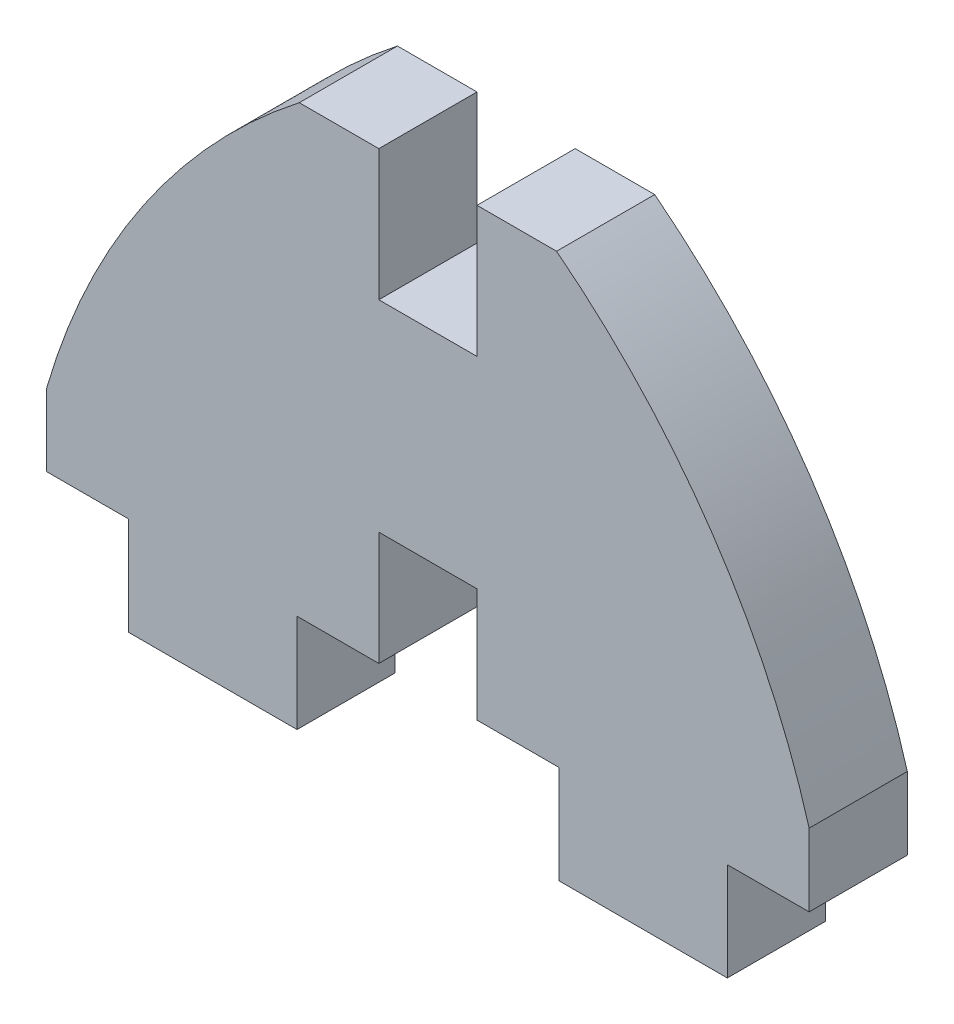
ISO-10303-21;
HEADER;
FILE_DESCRIPTION(('STEP AP214'),'2;1');
FILE_NAME('part.step','',(''),(''),'','','');
FILE_SCHEMA(('AUTOMOTIVE_DESIGN { 1 0 10303 214 1 1 1 1 }'));
ENDSEC;
DATA;
#1=APPLICATION_CONTEXT('core data for automotive mechanical design processes');
#2=APPLICATION_PROTOCOL_DEFINITION('international standard','automotive_design',2000,#1);
#3=PRODUCT_CONTEXT('',#1,'mechanical');
#4=PRODUCT('Part','Part','',(#3));
#5=PRODUCT_RELATED_PRODUCT_CATEGORY('part','',(#4));
#6=PRODUCT_DEFINITION_FORMATION('','',#4);
#7=PRODUCT_DEFINITION_CONTEXT('part definition',#1,'design');
#8=PRODUCT_DEFINITION('design','',#6,#7);
#9=PRODUCT_DEFINITION_SHAPE('','',#8);
#10=(LENGTH_UNIT() NAMED_UNIT(*) SI_UNIT(.MILLI.,.METRE.));
#11=(NAMED_UNIT(*) PLANE_ANGLE_UNIT() SI_UNIT($,.RADIAN.));
#12=(NAMED_UNIT(*) SI_UNIT($,.STERADIAN.) SOLID_ANGLE_UNIT());
#13=UNCERTAINTY_MEASURE_WITH_UNIT(LENGTH_MEASURE(1.E-05),#10,'distance_accuracy_value','');
#14=(GEOMETRIC_REPRESENTATION_CONTEXT(3) GLOBAL_UNCERTAINTY_ASSIGNED_CONTEXT((#13)) GLOBAL_UNIT_ASSIGNED_CONTEXT((#10,
#11,#12)) REPRESENTATION_CONTEXT('',''));
#15=CARTESIAN_POINT('',(0.,0.,0.));
#16=DIRECTION('',(0.,0.,1.));
#17=DIRECTION('',(1.,0.,0.));
#18=AXIS2_PLACEMENT_3D('',#15,#16,#17);
#19=CARTESIAN_POINT('',(-23.3,-6.95000000000001,6.));
#20=DIRECTION('',(-1.,0.,0.));
#21=DIRECTION('',(0.,0.,1.));
#22=AXIS2_PLACEMENT_3D('',#19,#20,#21);
#23=PLANE('',#22);
#24=DIRECTION('',(0.,1.,0.));
#25=VECTOR('',#24,1.);
#26=CARTESIAN_POINT('',(-23.3,-6.95000000000001,0.));
#27=LINE('',#26,#25);
#28=CARTESIAN_POINT('',(-23.3,-6.95000000000001,0.));
#29=VERTEX_POINT('',#28);
#30=CARTESIAN_POINT('',(-23.3,-2.51851851851852,0.));
#31=VERTEX_POINT('',#30);
#32=EDGE_CURVE('E214',#29,#31,#27,.T.);
#33=ORIENTED_EDGE('',*,*,#32,.F.);
#34=DIRECTION('',(0.,0.,-1.));
#35=VECTOR('',#34,1.);
#36=CARTESIAN_POINT('',(-23.3,-6.95000000000001,6.));
#37=LINE('',#36,#35);
#38=CARTESIAN_POINT('',(-23.3,-6.95000000000001,6.));
#39=VERTEX_POINT('',#38);
#40=EDGE_CURVE('E11',#39,#29,#37,.T.);
#41=ORIENTED_EDGE('',*,*,#40,.F.);
#42=DIRECTION('',(0.,1.,0.));
#43=VECTOR('',#42,1.);
#44=CARTESIAN_POINT('',(-23.3,-6.95000000000001,6.));
#45=LINE('',#44,#43);
#46=CARTESIAN_POINT('',(-23.3,-2.51851851851852,6.));
#47=VERTEX_POINT('',#46);
#48=EDGE_CURVE('E267',#39,#47,#45,.T.);
#49=ORIENTED_EDGE('',*,*,#48,.T.);
#50=DIRECTION('',(0.,0.,-1.));
#51=VECTOR('',#50,1.);
#52=CARTESIAN_POINT('',(-23.3,-2.51851851851852,6.));
#53=LINE('',#52,#51);
#54=EDGE_CURVE('E36',#47,#31,#53,.T.);
#55=ORIENTED_EDGE('',*,*,#54,.T.);
#56=EDGE_LOOP('',(#33,#41,#49,#55));
#57=FACE_BOUND('',#56,.T.);
#58=ADVANCED_FACE('F33',(#57),#23,.T.);
#59=CARTESIAN_POINT('',(-18.3,-6.95000000000001,6.));
#60=DIRECTION('',(0.,-1.,0.));
#61=DIRECTION('',(1.,0.,0.));
#62=AXIS2_PLACEMENT_3D('',#59,#60,#61);
#63=PLANE('',#62);
#64=DIRECTION('',(-1.,0.,0.));
#65=VECTOR('',#64,1.);
#66=CARTESIAN_POINT('',(-18.3,-6.95000000000001,0.));
#67=LINE('',#66,#65);
#68=CARTESIAN_POINT('',(-18.3,-6.95000000000001,0.));
#69=VERTEX_POINT('',#68);
#70=EDGE_CURVE('E265',#69,#29,#67,.T.);
#71=ORIENTED_EDGE('',*,*,#70,.F.);
#72=DIRECTION('',(0.,0.,-1.));
#73=VECTOR('',#72,1.);
#74=CARTESIAN_POINT('',(-18.3,-6.95000000000001,6.));
#75=LINE('',#74,#73);
#76=CARTESIAN_POINT('',(-18.3,-6.95000000000001,6.));
#77=VERTEX_POINT('',#76);
#78=EDGE_CURVE('E42',#77,#69,#75,.T.);
#79=ORIENTED_EDGE('',*,*,#78,.F.);
#80=DIRECTION('',(-1.,0.,0.));
#81=VECTOR('',#80,1.);
#82=CARTESIAN_POINT('',(-18.3,-6.95000000000001,6.));
#83=LINE('',#82,#81);
#84=EDGE_CURVE('E204',#77,#39,#83,.T.);
#85=ORIENTED_EDGE('',*,*,#84,.T.);
#86=ORIENTED_EDGE('',*,*,#40,.T.);
#87=EDGE_LOOP('',(#71,#79,#85,#86));
#88=FACE_BOUND('',#87,.T.);
#89=ADVANCED_FACE('F317',(#88),#63,.T.);
#90=CARTESIAN_POINT('',(-18.3,-12.95,6.));
#91=DIRECTION('',(-1.,0.,0.));
#92=DIRECTION('',(0.,-1.,0.));
#93=AXIS2_PLACEMENT_3D('',#90,#91,#92);
#94=PLANE('',#93);
#95=DIRECTION('',(0.,1.,0.));
#96=VECTOR('',#95,1.);
#97=CARTESIAN_POINT('',(-18.3,-12.95,0.));
#98=LINE('',#97,#96);
#99=CARTESIAN_POINT('',(-18.3,-12.95,0.));
#100=VERTEX_POINT('',#99);
#101=EDGE_CURVE('E191',#100,#69,#98,.T.);
#102=ORIENTED_EDGE('',*,*,#101,.F.);
#103=DIRECTION('',(0.,0.,-1.));
#104=VECTOR('',#103,1.);
#105=CARTESIAN_POINT('',(-18.3,-12.95,6.));
#106=LINE('',#105,#104);
#107=CARTESIAN_POINT('',(-18.3,-12.95,6.));
#108=VERTEX_POINT('',#107);
#109=EDGE_CURVE('E186',#108,#100,#106,.T.);
#110=ORIENTED_EDGE('',*,*,#109,.F.);
#111=DIRECTION('',(0.,1.,0.));
#112=VECTOR('',#111,1.);
#113=CARTESIAN_POINT('',(-18.3,-12.95,6.));
#114=LINE('',#113,#112);
#115=EDGE_CURVE('E189',#108,#77,#114,.T.);
#116=ORIENTED_EDGE('',*,*,#115,.T.);
#117=ORIENTED_EDGE('',*,*,#78,.T.);
#118=EDGE_LOOP('',(#102,#110,#116,#117));
#119=FACE_BOUND('',#118,.T.);
#120=ADVANCED_FACE('F188',(#119),#94,.T.);
#121=CARTESIAN_POINT('',(-8.,-12.95,6.));
#122=DIRECTION('',(0.,-1.,0.));
#123=DIRECTION('',(1.,0.,0.));
#124=AXIS2_PLACEMENT_3D('',#121,#122,#123);
#125=PLANE('',#124);
#126=DIRECTION('',(-1.,0.,0.));
#127=VECTOR('',#126,1.);
#128=CARTESIAN_POINT('',(-8.,-12.95,0.));
#129=LINE('',#128,#127);
#130=CARTESIAN_POINT('',(-8.,-12.95,0.));
#131=VERTEX_POINT('',#130);
#132=EDGE_CURVE('E262',#131,#100,#129,.T.);
#133=ORIENTED_EDGE('',*,*,#132,.F.);
#134=DIRECTION('',(0.,0.,-1.));
#135=VECTOR('',#134,1.);
#136=CARTESIAN_POINT('',(-8.,-12.95,6.));
#137=LINE('',#136,#135);
#138=CARTESIAN_POINT('',(-8.,-12.95,6.));
#139=VERTEX_POINT('',#138);
#140=EDGE_CURVE('E196',#139,#131,#137,.T.);
#141=ORIENTED_EDGE('',*,*,#140,.F.);
#142=DIRECTION('',(-1.,0.,0.));
#143=VECTOR('',#142,1.);
#144=CARTESIAN_POINT('',(-8.,-12.95,6.));
#145=LINE('',#144,#143);
#146=EDGE_CURVE('E202',#139,#108,#145,.T.);
#147=ORIENTED_EDGE('',*,*,#146,.T.);
#148=ORIENTED_EDGE('',*,*,#109,.T.);
#149=EDGE_LOOP('',(#133,#141,#147,#148));
#150=FACE_BOUND('',#149,.T.);
#151=ADVANCED_FACE('F206',(#150),#125,.T.);
#152=CARTESIAN_POINT('',(-8.,-6.95,6.));
#153=DIRECTION('',(1.,0.,0.));
#154=DIRECTION('',(0.,1.,0.));
#155=AXIS2_PLACEMENT_3D('',#152,#153,#154);
#156=PLANE('',#155);
#157=DIRECTION('',(0.,-1.,0.));
#158=VECTOR('',#157,1.);
#159=CARTESIAN_POINT('',(-8.,-6.95,0.));
#160=LINE('',#159,#158);
#161=CARTESIAN_POINT('',(-8.,-6.95,0.));
#162=VERTEX_POINT('',#161);
#163=EDGE_CURVE('E259',#162,#131,#160,.T.);
#164=ORIENTED_EDGE('',*,*,#163,.F.);
#165=DIRECTION('',(0.,0.,-1.));
#166=VECTOR('',#165,1.);
#167=CARTESIAN_POINT('',(-8.,-6.95,6.));
#168=LINE('',#167,#166);
#169=CARTESIAN_POINT('',(-8.,-6.95,6.));
#170=VERTEX_POINT('',#169);
#171=EDGE_CURVE('E271',#170,#162,#168,.T.);
#172=ORIENTED_EDGE('',*,*,#171,.F.);
#173=DIRECTION('',(0.,-1.,0.));
#174=VECTOR('',#173,1.);
#175=CARTESIAN_POINT('',(-8.,-6.95,6.));
#176=LINE('',#175,#174);
#177=EDGE_CURVE('E207',#170,#139,#176,.T.);
#178=ORIENTED_EDGE('',*,*,#177,.T.);
#179=ORIENTED_EDGE('',*,*,#140,.T.);
#180=EDGE_LOOP('',(#164,#172,#178,#179));
#181=FACE_BOUND('',#180,.T.);
#182=ADVANCED_FACE('F330',(#181),#156,.T.);
#183=CARTESIAN_POINT('',(-3.,-6.95,6.));
#184=DIRECTION('',(0.,-1.,0.));
#185=DIRECTION('',(0.,0.,-1.));
#186=AXIS2_PLACEMENT_3D('',#183,#184,#185);
#187=PLANE('',#186);
#188=DIRECTION('',(-1.,0.,0.));
#189=VECTOR('',#188,1.);
#190=CARTESIAN_POINT('',(-3.,-6.95,0.));
#191=LINE('',#190,#189);
#192=CARTESIAN_POINT('',(-3.,-6.95,0.));
#193=VERTEX_POINT('',#192);
#194=EDGE_CURVE('E256',#193,#162,#191,.T.);
#195=ORIENTED_EDGE('',*,*,#194,.F.);
#196=DIRECTION('',(0.,0.,-1.));
#197=VECTOR('',#196,1.);
#198=CARTESIAN_POINT('',(-3.,-6.95,6.));
#199=LINE('',#198,#197);
#200=CARTESIAN_POINT('',(-3.,-6.95,6.));
#201=VERTEX_POINT('',#200);
#202=EDGE_CURVE('E273',#201,#193,#199,.T.);
#203=ORIENTED_EDGE('',*,*,#202,.F.);
#204=DIRECTION('',(-1.,0.,0.));
#205=VECTOR('',#204,1.);
#206=CARTESIAN_POINT('',(-3.,-6.95,6.));
#207=LINE('',#206,#205);
#208=EDGE_CURVE('E209',#201,#170,#207,.T.);
#209=ORIENTED_EDGE('',*,*,#208,.T.);
#210=ORIENTED_EDGE('',*,*,#171,.T.);
#211=EDGE_LOOP('',(#195,#203,#209,#210));
#212=FACE_BOUND('',#211,.T.);
#213=ADVANCED_FACE('F333',(#212),#187,.T.);
#214=CARTESIAN_POINT('',(-3.,0.,6.));
#215=DIRECTION('',(1.,0.,0.));
#216=DIRECTION('',(0.,1.,0.));
#217=AXIS2_PLACEMENT_3D('',#214,#215,#216);
#218=PLANE('',#217);
#219=DIRECTION('',(0.,-1.,0.));
#220=VECTOR('',#219,1.);
#221=CARTESIAN_POINT('',(-3.,0.,0.));
#222=LINE('',#221,#220);
#223=CARTESIAN_POINT('',(-3.,0.,0.));
#224=VERTEX_POINT('',#223);
#225=EDGE_CURVE('E253',#224,#193,#222,.T.);
#226=ORIENTED_EDGE('',*,*,#225,.F.);
#227=DIRECTION('',(0.,0.,-1.));
#228=VECTOR('',#227,1.);
#229=CARTESIAN_POINT('',(-3.,0.,6.));
#230=LINE('',#229,#228);
#231=CARTESIAN_POINT('',(-3.,0.,6.));
#232=VERTEX_POINT('',#231);
#233=EDGE_CURVE('E275',#232,#224,#230,.T.);
#234=ORIENTED_EDGE('',*,*,#233,.F.);
#235=DIRECTION('',(0.,-1.,0.));
#236=VECTOR('',#235,1.);
#237=CARTESIAN_POINT('',(-3.,0.,6.));
#238=LINE('',#237,#236);
#239=EDGE_CURVE('E602',#232,#201,#238,.T.);
#240=ORIENTED_EDGE('',*,*,#239,.T.);
#241=ORIENTED_EDGE('',*,*,#202,.T.);
#242=EDGE_LOOP('',(#226,#234,#240,#241));
#243=FACE_BOUND('',#242,.T.);
#244=ADVANCED_FACE('F337',(#243),#218,.T.);
#245=CARTESIAN_POINT('',(3.,0.,6.));
#246=DIRECTION('',(0.,-1.,0.));
#247=DIRECTION('',(0.,0.,-1.));
#248=AXIS2_PLACEMENT_3D('',#245,#246,#247);
#249=PLANE('',#248);
#250=DIRECTION('',(-1.,0.,0.));
#251=VECTOR('',#250,1.);
#252=CARTESIAN_POINT('',(3.,0.,0.));
#253=LINE('',#252,#251);
#254=CARTESIAN_POINT('',(3.,0.,0.));
#255=VERTEX_POINT('',#254);
#256=EDGE_CURVE('E250',#255,#224,#253,.T.);
#257=ORIENTED_EDGE('',*,*,#256,.F.);
#258=DIRECTION('',(0.,0.,-1.));
#259=VECTOR('',#258,1.);
#260=CARTESIAN_POINT('',(3.,0.,6.));
#261=LINE('',#260,#259);
#262=CARTESIAN_POINT('',(3.,0.,6.));
#263=VERTEX_POINT('',#262);
#264=EDGE_CURVE('E277',#263,#255,#261,.T.);
#265=ORIENTED_EDGE('',*,*,#264,.F.);
#266=DIRECTION('',(-1.,0.,0.));
#267=VECTOR('',#266,1.);
#268=CARTESIAN_POINT('',(3.,0.,6.));
#269=LINE('',#268,#267);
#270=EDGE_CURVE('E595',#263,#232,#269,.T.);
#271=ORIENTED_EDGE('',*,*,#270,.T.);
#272=ORIENTED_EDGE('',*,*,#233,.T.);
#273=EDGE_LOOP('',(#257,#265,#271,#272));
#274=FACE_BOUND('',#273,.T.);
#275=ADVANCED_FACE('F341',(#274),#249,.T.);
#276=CARTESIAN_POINT('',(3.,0.,6.));
#277=DIRECTION('',(1.,0.,0.));
#278=DIRECTION('',(0.,1.,0.));
#279=AXIS2_PLACEMENT_3D('',#276,#277,#278);
#280=PLANE('',#279);
#281=DIRECTION('',(0.,-1.,0.));
#282=VECTOR('',#281,1.);
#283=CARTESIAN_POINT('',(3.,0.,0.));
#284=LINE('',#283,#282);
#285=CARTESIAN_POINT('',(3.,-6.95,0.));
#286=VERTEX_POINT('',#285);
#287=EDGE_CURVE('E248',#255,#286,#284,.T.);
#288=ORIENTED_EDGE('',*,*,#287,.T.);
#289=DIRECTION('',(0.,0.,-1.));
#290=VECTOR('',#289,1.);
#291=CARTESIAN_POINT('',(3.,-6.95,6.));
#292=LINE('',#291,#290);
#293=CARTESIAN_POINT('',(3.,-6.95,6.));
#294=VERTEX_POINT('',#293);
#295=EDGE_CURVE('E279',#294,#286,#292,.T.);
#296=ORIENTED_EDGE('',*,*,#295,.F.);
#297=DIRECTION('',(0.,-1.,0.));
#298=VECTOR('',#297,1.);
#299=CARTESIAN_POINT('',(3.,0.,6.));
#300=LINE('',#299,#298);
#301=EDGE_CURVE('E590',#263,#294,#300,.T.);
#302=ORIENTED_EDGE('',*,*,#301,.F.);
#303=ORIENTED_EDGE('',*,*,#264,.T.);
#304=EDGE_LOOP('',(#288,#296,#302,#303));
#305=FACE_BOUND('',#304,.T.);
#306=ADVANCED_FACE('F345',(#305),#280,.F.);
#307=CARTESIAN_POINT('',(3.,-6.95,6.));
#308=DIRECTION('',(0.,1.,0.));
#309=DIRECTION('',(0.,0.,1.));
#310=AXIS2_PLACEMENT_3D('',#307,#308,#309);
#311=PLANE('',#310);
#312=DIRECTION('',(1.,0.,0.));
#313=VECTOR('',#312,1.);
#314=CARTESIAN_POINT('',(3.,-6.95,0.));
#315=LINE('',#314,#313);
#316=CARTESIAN_POINT('',(8.,-6.95,0.));
#317=VERTEX_POINT('',#316);
#318=EDGE_CURVE('E246',#286,#317,#315,.T.);
#319=ORIENTED_EDGE('',*,*,#318,.T.);
#320=DIRECTION('',(0.,0.,-1.));
#321=VECTOR('',#320,1.);
#322=CARTESIAN_POINT('',(8.,-6.95,6.));
#323=LINE('',#322,#321);
#324=CARTESIAN_POINT('',(8.,-6.95,6.));
#325=VERTEX_POINT('',#324);
#326=EDGE_CURVE('E282',#325,#317,#323,.T.);
#327=ORIENTED_EDGE('',*,*,#326,.F.);
#328=DIRECTION('',(1.,0.,0.));
#329=VECTOR('',#328,1.);
#330=CARTESIAN_POINT('',(3.,-6.95,6.));
#331=LINE('',#330,#329);
#332=EDGE_CURVE('E587',#294,#325,#331,.T.);
#333=ORIENTED_EDGE('',*,*,#332,.F.);
#334=ORIENTED_EDGE('',*,*,#295,.T.);
#335=EDGE_LOOP('',(#319,#327,#333,#334));
#336=FACE_BOUND('',#335,.T.);
#337=ADVANCED_FACE('F349',(#336),#311,.F.);
#338=CARTESIAN_POINT('',(8.,-6.95,6.));
#339=DIRECTION('',(1.,0.,0.));
#340=DIRECTION('',(0.,1.,0.));
#341=AXIS2_PLACEMENT_3D('',#338,#339,#340);
#342=PLANE('',#341);
#343=DIRECTION('',(0.,-1.,0.));
#344=VECTOR('',#343,1.);
#345=CARTESIAN_POINT('',(8.,-6.95,0.));
#346=LINE('',#345,#344);
#347=CARTESIAN_POINT('',(8.,-12.95,0.));
#348=VERTEX_POINT('',#347);
#349=EDGE_CURVE('E244',#317,#348,#346,.T.);
#350=ORIENTED_EDGE('',*,*,#349,.T.);
#351=DIRECTION('',(0.,0.,-1.));
#352=VECTOR('',#351,1.);
#353=CARTESIAN_POINT('',(8.,-12.95,6.));
#354=LINE('',#353,#352);
#355=CARTESIAN_POINT('',(8.,-12.95,6.));
#356=VERTEX_POINT('',#355);
#357=EDGE_CURVE('E285',#356,#348,#354,.T.);
#358=ORIENTED_EDGE('',*,*,#357,.F.);
#359=DIRECTION('',(0.,-1.,0.));
#360=VECTOR('',#359,1.);
#361=CARTESIAN_POINT('',(8.,-6.95,6.));
#362=LINE('',#361,#360);
#363=EDGE_CURVE('E585',#325,#356,#362,.T.);
#364=ORIENTED_EDGE('',*,*,#363,.F.);
#365=ORIENTED_EDGE('',*,*,#326,.T.);
#366=EDGE_LOOP('',(#350,#358,#364,#365));
#367=FACE_BOUND('',#366,.T.);
#368=ADVANCED_FACE('F353',(#367),#342,.F.);
#369=CARTESIAN_POINT('',(8.,-12.95,6.));
#370=DIRECTION('',(0.,1.,0.));
#371=DIRECTION('',(-1.,0.,0.));
#372=AXIS2_PLACEMENT_3D('',#369,#370,#371);
#373=PLANE('',#372);
#374=DIRECTION('',(1.,0.,0.));
#375=VECTOR('',#374,1.);
#376=CARTESIAN_POINT('',(8.,-12.95,0.));
#377=LINE('',#376,#375);
#378=CARTESIAN_POINT('',(18.3,-12.95,0.));
#379=VERTEX_POINT('',#378);
#380=EDGE_CURVE('E242',#348,#379,#377,.T.);
#381=ORIENTED_EDGE('',*,*,#380,.T.);
#382=DIRECTION('',(0.,0.,-1.));
#383=VECTOR('',#382,1.);
#384=CARTESIAN_POINT('',(18.3,-12.95,6.));
#385=LINE('',#384,#383);
#386=CARTESIAN_POINT('',(18.3,-12.95,6.));
#387=VERTEX_POINT('',#386);
#388=EDGE_CURVE('E288',#387,#379,#385,.T.);
#389=ORIENTED_EDGE('',*,*,#388,.F.);
#390=DIRECTION('',(1.,0.,0.));
#391=VECTOR('',#390,1.);
#392=CARTESIAN_POINT('',(8.,-12.95,6.));
#393=LINE('',#392,#391);
#394=EDGE_CURVE('E578',#356,#387,#393,.T.);
#395=ORIENTED_EDGE('',*,*,#394,.F.);
#396=ORIENTED_EDGE('',*,*,#357,.T.);
#397=EDGE_LOOP('',(#381,#389,#395,#396));
#398=FACE_BOUND('',#397,.T.);
#399=ADVANCED_FACE('F357',(#398),#373,.F.);
#400=CARTESIAN_POINT('',(18.3,-12.95,6.));
#401=DIRECTION('',(-1.,0.,0.));
#402=DIRECTION('',(0.,-1.,0.));
#403=AXIS2_PLACEMENT_3D('',#400,#401,#402);
#404=PLANE('',#403);
#405=DIRECTION('',(0.,1.,0.));
#406=VECTOR('',#405,1.);
#407=CARTESIAN_POINT('',(18.3,-12.95,0.));
#408=LINE('',#407,#406);
#409=CARTESIAN_POINT('',(18.3,-6.95000000000001,0.));
#410=VERTEX_POINT('',#409);
#411=EDGE_CURVE('E240',#379,#410,#408,.T.);
#412=ORIENTED_EDGE('',*,*,#411,.T.);
#413=DIRECTION('',(0.,0.,-1.));
#414=VECTOR('',#413,1.);
#415=CARTESIAN_POINT('',(18.3,-6.95000000000001,6.));
#416=LINE('',#415,#414);
#417=CARTESIAN_POINT('',(18.3,-6.95000000000001,6.));
#418=VERTEX_POINT('',#417);
#419=EDGE_CURVE('E291',#418,#410,#416,.T.);
#420=ORIENTED_EDGE('',*,*,#419,.F.);
#421=DIRECTION('',(0.,1.,0.));
#422=VECTOR('',#421,1.);
#423=CARTESIAN_POINT('',(18.3,-12.95,6.));
#424=LINE('',#423,#422);
#425=EDGE_CURVE('E575',#387,#418,#424,.T.);
#426=ORIENTED_EDGE('',*,*,#425,.F.);
#427=ORIENTED_EDGE('',*,*,#388,.T.);
#428=EDGE_LOOP('',(#412,#420,#426,#427));
#429=FACE_BOUND('',#428,.T.);
#430=ADVANCED_FACE('F361',(#429),#404,.F.);
#431=CARTESIAN_POINT('',(18.3,-6.95000000000001,6.));
#432=DIRECTION('',(0.,1.,0.));
#433=DIRECTION('',(-1.,0.,0.));
#434=AXIS2_PLACEMENT_3D('',#431,#432,#433);
#435=PLANE('',#434);
#436=DIRECTION('',(1.,0.,0.));
#437=VECTOR('',#436,1.);
#438=CARTESIAN_POINT('',(18.3,-6.95000000000001,0.));
#439=LINE('',#438,#437);
#440=CARTESIAN_POINT('',(23.3,-6.95000000000001,0.));
#441=VERTEX_POINT('',#440);
#442=EDGE_CURVE('E238',#410,#441,#439,.T.);
#443=ORIENTED_EDGE('',*,*,#442,.T.);
#444=DIRECTION('',(0.,0.,-1.));
#445=VECTOR('',#444,1.);
#446=CARTESIAN_POINT('',(23.3,-6.95000000000001,6.));
#447=LINE('',#446,#445);
#448=CARTESIAN_POINT('',(23.3,-6.95000000000001,6.));
#449=VERTEX_POINT('',#448);
#450=EDGE_CURVE('E294',#449,#441,#447,.T.);
#451=ORIENTED_EDGE('',*,*,#450,.F.);
#452=DIRECTION('',(1.,0.,0.));
#453=VECTOR('',#452,1.);
#454=CARTESIAN_POINT('',(18.3,-6.95000000000001,6.));
#455=LINE('',#454,#453);
#456=EDGE_CURVE('E573',#418,#449,#455,.T.);
#457=ORIENTED_EDGE('',*,*,#456,.F.);
#458=ORIENTED_EDGE('',*,*,#419,.T.);
#459=EDGE_LOOP('',(#443,#451,#457,#458));
#460=FACE_BOUND('',#459,.T.);
#461=ADVANCED_FACE('F365',(#460),#435,.F.);
#462=CARTESIAN_POINT('',(23.3,-6.95000000000001,6.));
#463=DIRECTION('',(-1.,0.,0.));
#464=DIRECTION('',(0.,0.,1.));
#465=AXIS2_PLACEMENT_3D('',#462,#463,#464);
#466=PLANE('',#465);
#467=DIRECTION('',(0.,1.,0.));
#468=VECTOR('',#467,1.);
#469=CARTESIAN_POINT('',(23.3,-6.95000000000001,0.));
#470=LINE('',#469,#468);
#471=CARTESIAN_POINT('',(23.3,-2.51851851851852,0.));
#472=VERTEX_POINT('',#471);
#473=EDGE_CURVE('E236',#441,#472,#470,.T.);
#474=ORIENTED_EDGE('',*,*,#473,.T.);
#475=DIRECTION('',(0.,0.,-1.));
#476=VECTOR('',#475,1.);
#477=CARTESIAN_POINT('',(23.3,-2.51851851851852,6.));
#478=LINE('',#477,#476);
#479=CARTESIAN_POINT('',(23.3,-2.51851851851852,6.));
#480=VERTEX_POINT('',#479);
#481=EDGE_CURVE('E297',#480,#472,#478,.T.);
#482=ORIENTED_EDGE('',*,*,#481,.F.);
#483=DIRECTION('',(0.,1.,0.));
#484=VECTOR('',#483,1.);
#485=CARTESIAN_POINT('',(23.3,-6.95000000000001,6.));
#486=LINE('',#485,#484);
#487=EDGE_CURVE('E566',#449,#480,#486,.T.);
#488=ORIENTED_EDGE('',*,*,#487,.F.);
#489=ORIENTED_EDGE('',*,*,#450,.T.);
#490=EDGE_LOOP('',(#474,#482,#488,#489));
#491=FACE_BOUND('',#490,.T.);
#492=ADVANCED_FACE('F369',(#491),#466,.F.);
#493=CARTESIAN_POINT('',(-19.5785771108741,-14.8951701462014,6.));
#494=DIRECTION('',(0.,0.,-1.));
#495=DIRECTION('',(-1.,0.,0.));
#496=AXIS2_PLACEMENT_3D('',#493,#494,#495);
#497=CYLINDRICAL_SURFACE('',#496,44.6290699047852);
#498=CARTESIAN_POINT('',(-19.5785771108741,-14.8951701462014,0.));
#499=DIRECTION('',(0.,0.,1.));
#500=DIRECTION('',(1.,0.,0.));
#501=AXIS2_PLACEMENT_3D('',#498,#499,#500);
#502=CIRCLE('',#501,44.6290699047852);
#503=CARTESIAN_POINT('',(7.86325006856376,20.3,0.));
#504=VERTEX_POINT('',#503);
#505=EDGE_CURVE('E233',#472,#504,#502,.T.);
#506=ORIENTED_EDGE('',*,*,#505,.T.);
#507=DIRECTION('',(0.,0.,-1.));
#508=VECTOR('',#507,1.);
#509=CARTESIAN_POINT('',(7.86325006856376,20.3,6.));
#510=LINE('',#509,#508);
#511=CARTESIAN_POINT('',(7.86325006856376,20.3,6.));
#512=VERTEX_POINT('',#511);
#513=EDGE_CURVE('E300',#512,#504,#510,.T.);
#514=ORIENTED_EDGE('',*,*,#513,.F.);
#515=CARTESIAN_POINT('',(-19.5785771108741,-14.8951701462014,6.));
#516=DIRECTION('',(0.,0.,1.));
#517=DIRECTION('',(1.,0.,0.));
#518=AXIS2_PLACEMENT_3D('',#515,#516,#517);
#519=CIRCLE('',#518,44.6290699047852);
#520=EDGE_CURVE('E564',#480,#512,#519,.T.);
#521=ORIENTED_EDGE('',*,*,#520,.F.);
#522=ORIENTED_EDGE('',*,*,#481,.T.);
#523=EDGE_LOOP('',(#506,#514,#521,#522));
#524=FACE_BOUND('',#523,.T.);
#525=ADVANCED_FACE('F373',(#524),#497,.T.);
#526=CARTESIAN_POINT('',(3.,20.3,6.));
#527=DIRECTION('',(0.,1.,0.));
#528=DIRECTION('',(-1.,0.,0.));
#529=AXIS2_PLACEMENT_3D('',#526,#527,#528);
#530=PLANE('',#529);
#531=DIRECTION('',(1.,0.,0.));
#532=VECTOR('',#531,1.);
#533=CARTESIAN_POINT('',(3.,20.3,0.));
#534=LINE('',#533,#532);
#535=CARTESIAN_POINT('',(3.,20.3,0.));
#536=VERTEX_POINT('',#535);
#537=EDGE_CURVE('E230',#536,#504,#534,.T.);
#538=ORIENTED_EDGE('',*,*,#537,.F.);
#539=DIRECTION('',(0.,0.,-1.));
#540=VECTOR('',#539,1.);
#541=CARTESIAN_POINT('',(3.,20.3,6.));
#542=LINE('',#541,#540);
#543=CARTESIAN_POINT('',(3.,20.3,6.));
#544=VERTEX_POINT('',#543);
#545=EDGE_CURVE('E302',#544,#536,#542,.T.);
#546=ORIENTED_EDGE('',*,*,#545,.F.);
#547=DIRECTION('',(1.,0.,0.));
#548=VECTOR('',#547,1.);
#549=CARTESIAN_POINT('',(3.,20.3,6.));
#550=LINE('',#549,#548);
#551=EDGE_CURVE('E561',#544,#512,#550,.T.);
#552=ORIENTED_EDGE('',*,*,#551,.T.);
#553=ORIENTED_EDGE('',*,*,#513,.T.);
#554=EDGE_LOOP('',(#538,#546,#552,#553));
#555=FACE_BOUND('',#554,.T.);
#556=ADVANCED_FACE('F377',(#555),#530,.T.);
#557=CARTESIAN_POINT('',(3.,12.3,6.));
#558=DIRECTION('',(-1.,0.,0.));
#559=DIRECTION('',(0.,0.,1.));
#560=AXIS2_PLACEMENT_3D('',#557,#558,#559);
#561=PLANE('',#560);
#562=DIRECTION('',(0.,1.,0.));
#563=VECTOR('',#562,1.);
#564=CARTESIAN_POINT('',(3.,12.3,0.));
#565=LINE('',#564,#563);
#566=CARTESIAN_POINT('',(3.,12.3,0.));
#567=VERTEX_POINT('',#566);
#568=EDGE_CURVE('E227',#567,#536,#565,.T.);
#569=ORIENTED_EDGE('',*,*,#568,.F.);
#570=DIRECTION('',(0.,0.,-1.));
#571=VECTOR('',#570,1.);
#572=CARTESIAN_POINT('',(3.,12.3,6.));
#573=LINE('',#572,#571);
#574=CARTESIAN_POINT('',(3.,12.3,6.));
#575=VERTEX_POINT('',#574);
#576=EDGE_CURVE('E304',#575,#567,#573,.T.);
#577=ORIENTED_EDGE('',*,*,#576,.F.);
#578=DIRECTION('',(0.,1.,0.));
#579=VECTOR('',#578,1.);
#580=CARTESIAN_POINT('',(3.,12.3,6.));
#581=LINE('',#580,#579);
#582=EDGE_CURVE('E554',#575,#544,#581,.T.);
#583=ORIENTED_EDGE('',*,*,#582,.T.);
#584=ORIENTED_EDGE('',*,*,#545,.T.);
#585=EDGE_LOOP('',(#569,#577,#583,#584));
#586=FACE_BOUND('',#585,.T.);
#587=ADVANCED_FACE('F381',(#586),#561,.T.);
#588=CARTESIAN_POINT('',(3.,12.3,6.));
#589=DIRECTION('',(0.,-1.,0.));
#590=DIRECTION('',(1.,0.,0.));
#591=AXIS2_PLACEMENT_3D('',#588,#589,#590);
#592=PLANE('',#591);
#593=DIRECTION('',(-1.,0.,0.));
#594=VECTOR('',#593,1.);
#595=CARTESIAN_POINT('',(3.,12.3,0.));
#596=LINE('',#595,#594);
#597=CARTESIAN_POINT('',(-3.,12.3,0.));
#598=VERTEX_POINT('',#597);
#599=EDGE_CURVE('E225',#567,#598,#596,.T.);
#600=ORIENTED_EDGE('',*,*,#599,.T.);
#601=DIRECTION('',(0.,0.,-1.));
#602=VECTOR('',#601,1.);
#603=CARTESIAN_POINT('',(-3.,12.3,6.));
#604=LINE('',#603,#602);
#605=CARTESIAN_POINT('',(-3.,12.3,6.));
#606=VERTEX_POINT('',#605);
#607=EDGE_CURVE('E306',#606,#598,#604,.T.);
#608=ORIENTED_EDGE('',*,*,#607,.F.);
#609=DIRECTION('',(-1.,0.,0.));
#610=VECTOR('',#609,1.);
#611=CARTESIAN_POINT('',(3.,12.3,6.));
#612=LINE('',#611,#610);
#613=EDGE_CURVE('E551',#575,#606,#612,.T.);
#614=ORIENTED_EDGE('',*,*,#613,.F.);
#615=ORIENTED_EDGE('',*,*,#576,.T.);
#616=EDGE_LOOP('',(#600,#608,#614,#615));
#617=FACE_BOUND('',#616,.T.);
#618=ADVANCED_FACE('F385',(#617),#592,.F.);
#619=CARTESIAN_POINT('',(-3.,12.3,6.));
#620=DIRECTION('',(-1.,0.,0.));
#621=DIRECTION('',(0.,0.,1.));
#622=AXIS2_PLACEMENT_3D('',#619,#620,#621);
#623=PLANE('',#622);
#624=DIRECTION('',(0.,1.,0.));
#625=VECTOR('',#624,1.);
#626=CARTESIAN_POINT('',(-3.,12.3,0.));
#627=LINE('',#626,#625);
#628=CARTESIAN_POINT('',(-3.,20.3,0.));
#629=VERTEX_POINT('',#628);
#630=EDGE_CURVE('E223',#598,#629,#627,.T.);
#631=ORIENTED_EDGE('',*,*,#630,.T.);
#632=DIRECTION('',(0.,0.,-1.));
#633=VECTOR('',#632,1.);
#634=CARTESIAN_POINT('',(-3.,20.3,6.));
#635=LINE('',#634,#633);
#636=CARTESIAN_POINT('',(-3.,20.3,6.));
#637=VERTEX_POINT('',#636);
#638=EDGE_CURVE('E309',#637,#629,#635,.T.);
#639=ORIENTED_EDGE('',*,*,#638,.F.);
#640=DIRECTION('',(0.,1.,0.));
#641=VECTOR('',#640,1.);
#642=CARTESIAN_POINT('',(-3.,12.3,6.));
#643=LINE('',#642,#641);
#644=EDGE_CURVE('E549',#606,#637,#643,.T.);
#645=ORIENTED_EDGE('',*,*,#644,.F.);
#646=ORIENTED_EDGE('',*,*,#607,.T.);
#647=EDGE_LOOP('',(#631,#639,#645,#646));
#648=FACE_BOUND('',#647,.T.);
#649=ADVANCED_FACE('F389',(#648),#623,.F.);
#650=CARTESIAN_POINT('',(-3.,20.3,6.));
#651=DIRECTION('',(0.,-1.,0.));
#652=DIRECTION('',(1.,0.,0.));
#653=AXIS2_PLACEMENT_3D('',#650,#651,#652);
#654=PLANE('',#653);
#655=DIRECTION('',(-1.,0.,0.));
#656=VECTOR('',#655,1.);
#657=CARTESIAN_POINT('',(-3.,20.3,0.));
#658=LINE('',#657,#656);
#659=CARTESIAN_POINT('',(-7.86325006856376,20.3,0.));
#660=VERTEX_POINT('',#659);
#661=EDGE_CURVE('E220',#629,#660,#658,.T.);
#662=ORIENTED_EDGE('',*,*,#661,.T.);
#663=DIRECTION('',(0.,0.,-1.));
#664=VECTOR('',#663,1.);
#665=CARTESIAN_POINT('',(-7.86325006856376,20.3,6.));
#666=LINE('',#665,#664);
#667=CARTESIAN_POINT('',(-7.86325006856376,20.3,6.));
#668=VERTEX_POINT('',#667);
#669=EDGE_CURVE('E311',#668,#660,#666,.T.);
#670=ORIENTED_EDGE('',*,*,#669,.F.);
#671=DIRECTION('',(-1.,0.,0.));
#672=VECTOR('',#671,1.);
#673=CARTESIAN_POINT('',(-3.,20.3,6.));
#674=LINE('',#673,#672);
#675=EDGE_CURVE('E618',#637,#668,#674,.T.);
#676=ORIENTED_EDGE('',*,*,#675,.F.);
#677=ORIENTED_EDGE('',*,*,#638,.T.);
#678=EDGE_LOOP('',(#662,#670,#676,#677));
#679=FACE_BOUND('',#678,.T.);
#680=ADVANCED_FACE('F393',(#679),#654,.F.);
#681=CARTESIAN_POINT('',(19.5785771108741,-14.8951701462014,6.));
#682=DIRECTION('',(0.,0.,-1.));
#683=DIRECTION('',(-1.,0.,0.));
#684=AXIS2_PLACEMENT_3D('',#681,#682,#683);
#685=CYLINDRICAL_SURFACE('',#684,44.6290699047852);
#686=CARTESIAN_POINT('',(19.5785771108741,-14.8951701462014,0.));
#687=DIRECTION('',(0.,0.,-1.));
#688=DIRECTION('',(-1.,0.,0.));
#689=AXIS2_PLACEMENT_3D('',#686,#687,#688);
#690=CIRCLE('',#689,44.6290699047852);
#691=EDGE_CURVE('E217',#31,#660,#690,.T.);
#692=ORIENTED_EDGE('',*,*,#691,.F.);
#693=ORIENTED_EDGE('',*,*,#54,.F.);
#694=CARTESIAN_POINT('',(19.5785771108741,-14.8951701462014,6.));
#695=DIRECTION('',(0.,0.,-1.));
#696=DIRECTION('',(-1.,0.,0.));
#697=AXIS2_PLACEMENT_3D('',#694,#695,#696);
#698=CIRCLE('',#697,44.6290699047852);
#699=EDGE_CURVE('E620',#47,#668,#698,.T.);
#700=ORIENTED_EDGE('',*,*,#699,.T.);
#701=ORIENTED_EDGE('',*,*,#669,.T.);
#702=EDGE_LOOP('',(#692,#693,#700,#701));
#703=FACE_BOUND('',#702,.T.);
#704=ADVANCED_FACE('F313',(#703),#685,.T.);
#705=CARTESIAN_POINT('',(19.5785771108741,-14.8951701462014,6.));
#706=DIRECTION('',(0.,0.,-1.));
#707=DIRECTION('',(-1.,0.,0.));
#708=AXIS2_PLACEMENT_3D('',#705,#706,#707);
#709=PLANE('',#708);
#710=ORIENTED_EDGE('',*,*,#48,.F.);
#711=ORIENTED_EDGE('',*,*,#84,.F.);
#712=ORIENTED_EDGE('',*,*,#115,.F.);
#713=ORIENTED_EDGE('',*,*,#146,.F.);
#714=ORIENTED_EDGE('',*,*,#177,.F.);
#715=ORIENTED_EDGE('',*,*,#208,.F.);
#716=ORIENTED_EDGE('',*,*,#239,.F.);
#717=ORIENTED_EDGE('',*,*,#270,.F.);
#718=ORIENTED_EDGE('',*,*,#301,.T.);
#719=ORIENTED_EDGE('',*,*,#332,.T.);
#720=ORIENTED_EDGE('',*,*,#363,.T.);
#721=ORIENTED_EDGE('',*,*,#394,.T.);
#722=ORIENTED_EDGE('',*,*,#425,.T.);
#723=ORIENTED_EDGE('',*,*,#456,.T.);
#724=ORIENTED_EDGE('',*,*,#487,.T.);
#725=ORIENTED_EDGE('',*,*,#520,.T.);
#726=ORIENTED_EDGE('',*,*,#551,.F.);
#727=ORIENTED_EDGE('',*,*,#582,.F.);
#728=ORIENTED_EDGE('',*,*,#613,.T.);
#729=ORIENTED_EDGE('',*,*,#644,.T.);
#730=ORIENTED_EDGE('',*,*,#675,.T.);
#731=ORIENTED_EDGE('',*,*,#699,.F.);
#732=EDGE_LOOP('',(#710,#711,#712,#713,#714,#715,#716,#717,#718,#719,#720,#721,#722,#723,#724,
#725,#726,#727,#728,#729,#730,#731));
#733=FACE_BOUND('',#732,.T.);
#734=ADVANCED_FACE('F200',(#733),#709,.F.);
#735=CARTESIAN_POINT('',(19.5785771108741,-14.8951701462014,0.));
#736=DIRECTION('',(0.,0.,-1.));
#737=DIRECTION('',(-1.,0.,0.));
#738=AXIS2_PLACEMENT_3D('',#735,#736,#737);
#739=PLANE('',#738);
#740=ORIENTED_EDGE('',*,*,#32,.T.);
#741=ORIENTED_EDGE('',*,*,#691,.T.);
#742=ORIENTED_EDGE('',*,*,#661,.F.);
#743=ORIENTED_EDGE('',*,*,#630,.F.);
#744=ORIENTED_EDGE('',*,*,#599,.F.);
#745=ORIENTED_EDGE('',*,*,#568,.T.);
#746=ORIENTED_EDGE('',*,*,#537,.T.);
#747=ORIENTED_EDGE('',*,*,#505,.F.);
#748=ORIENTED_EDGE('',*,*,#473,.F.);
#749=ORIENTED_EDGE('',*,*,#442,.F.);
#750=ORIENTED_EDGE('',*,*,#411,.F.);
#751=ORIENTED_EDGE('',*,*,#380,.F.);
#752=ORIENTED_EDGE('',*,*,#349,.F.);
#753=ORIENTED_EDGE('',*,*,#318,.F.);
#754=ORIENTED_EDGE('',*,*,#287,.F.);
#755=ORIENTED_EDGE('',*,*,#256,.T.);
#756=ORIENTED_EDGE('',*,*,#225,.T.);
#757=ORIENTED_EDGE('',*,*,#194,.T.);
#758=ORIENTED_EDGE('',*,*,#163,.T.);
#759=ORIENTED_EDGE('',*,*,#132,.T.);
#760=ORIENTED_EDGE('',*,*,#101,.T.);
#761=ORIENTED_EDGE('',*,*,#70,.T.);
#762=EDGE_LOOP('',(#740,#741,#742,#743,#744,#745,#746,#747,#748,#749,#750,#751,#752,#753,#754,
#755,#756,#757,#758,#759,#760,#761));
#763=FACE_BOUND('',#762,.T.);
#764=ADVANCED_FACE('F316',(#763),#739,.T.);
#765=CLOSED_SHELL('',(#58,#89,#120,#151,#182,#213,#244,#275,#306,#337,#368,#399,#430,#461,#492,
#525,#556,#587,#618,#649,#680,#704,#734,#764));
#766=MANIFOLD_SOLID_BREP('B2',#765);
#767=ADVANCED_BREP_SHAPE_REPRESENTATION('',(#18,#766),#14);
#768=SHAPE_DEFINITION_REPRESENTATION(#9,#767);
ENDSEC;
END-ISO-10303-21;
